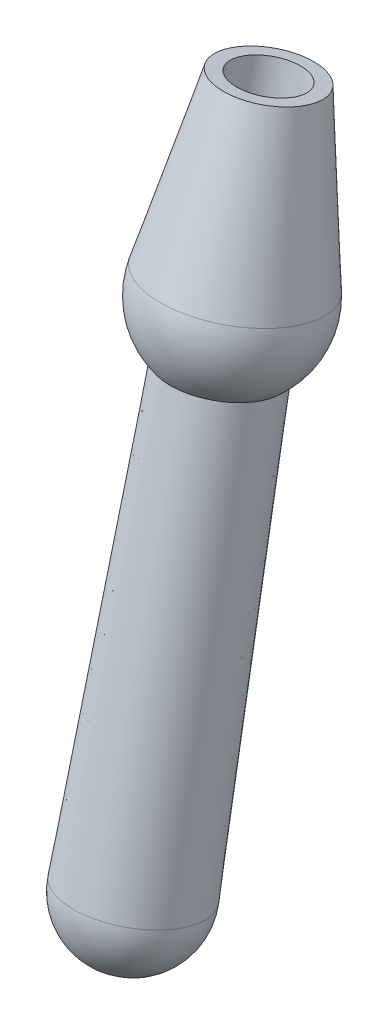
ISO-10303-21;
HEADER;
FILE_DESCRIPTION(('STEP AP214'),'2;1');
FILE_NAME('part.step','',(''),(''),'','','');
FILE_SCHEMA(('AUTOMOTIVE_DESIGN { 1 0 10303 214 1 1 1 1 }'));
ENDSEC;
DATA;
#1=APPLICATION_CONTEXT('core data for automotive mechanical design processes');
#2=APPLICATION_PROTOCOL_DEFINITION('international standard','automotive_design',2000,#1);
#3=PRODUCT_CONTEXT('',#1,'mechanical');
#4=PRODUCT('Part','Part','',(#3));
#5=PRODUCT_RELATED_PRODUCT_CATEGORY('part','',(#4));
#6=PRODUCT_DEFINITION_FORMATION('','',#4);
#7=PRODUCT_DEFINITION_CONTEXT('part definition',#1,'design');
#8=PRODUCT_DEFINITION('design','',#6,#7);
#9=PRODUCT_DEFINITION_SHAPE('','',#8);
#10=(LENGTH_UNIT() NAMED_UNIT(*) SI_UNIT(.MILLI.,.METRE.));
#11=(NAMED_UNIT(*) PLANE_ANGLE_UNIT() SI_UNIT($,.RADIAN.));
#12=(NAMED_UNIT(*) SI_UNIT($,.STERADIAN.) SOLID_ANGLE_UNIT());
#13=UNCERTAINTY_MEASURE_WITH_UNIT(LENGTH_MEASURE(1.E-05),#10,'distance_accuracy_value','');
#14=(GEOMETRIC_REPRESENTATION_CONTEXT(3) GLOBAL_UNCERTAINTY_ASSIGNED_CONTEXT((#13)) GLOBAL_UNIT_ASSIGNED_CONTEXT((#10,
#11,#12)) REPRESENTATION_CONTEXT('',''));
#15=CARTESIAN_POINT('',(0.,0.,0.));
#16=DIRECTION('',(0.,0.,1.));
#17=DIRECTION('',(1.,0.,0.));
#18=AXIS2_PLACEMENT_3D('',#15,#16,#17);
#19=CARTESIAN_POINT('',(0.,-5.43277859889929,1.55863020646956));
#20=DIRECTION('',(0.,0.978147600733806,-0.207911690817759));
#21=DIRECTION('',(0.,-0.207911690817759,-0.978147600733806));
#22=AXIS2_PLACEMENT_3D('',#19,#20,#21);
#23=SPHERICAL_SURFACE('',#22,0.8);
#24=CARTESIAN_POINT('',(0.,-5.4327785988993,1.55863020646956));
#25=DIRECTION('',(0.,0.978147600733806,-0.207911690817759));
#26=DIRECTION('',(0.,-0.207911690817759,-0.978147600733806));
#27=AXIS2_PLACEMENT_3D('',#24,#25,#26);
#28=CIRCLE('',#27,0.8);
#29=CARTESIAN_POINT('',(0.,-5.5991079515535,0.776112125882512));
#30=VERTEX_POINT('',#29);
#31=EDGE_CURVE('E11',#30,#30,#28,.T.);
#32=ORIENTED_EDGE('',*,*,#31,.T.);
#33=EDGE_LOOP('',(#32));
#34=FACE_BOUND('',#33,.T.);
#35=ADVANCED_FACE('F16',(#34),#23,.F.);
#36=CARTESIAN_POINT('',(0.,6.10936308975959,-0.894727745179999));
#37=DIRECTION('',(0.,0.978147600733806,-0.207911690817759));
#38=DIRECTION('',(0.,-0.207911690817759,-0.978147600733806));
#39=AXIS2_PLACEMENT_3D('',#36,#37,#38);
#40=CYLINDRICAL_SURFACE('',#39,0.8);
#41=ORIENTED_EDGE('',*,*,#31,.F.);
#42=EDGE_LOOP('',(#41));
#43=FACE_BOUND('',#42,.T.);
#44=CARTESIAN_POINT('',(0.,6.10936308975959,-0.894727745179999));
#45=DIRECTION('',(0.,0.978147600733806,-0.207911690817759));
#46=DIRECTION('',(0.,-0.207911690817759,-0.978147600733806));
#47=AXIS2_PLACEMENT_3D('',#44,#45,#46);
#48=CIRCLE('',#47,0.8);
#49=CARTESIAN_POINT('',(0.,5.94303373710538,-1.67724582576704));
#50=VERTEX_POINT('',#49);
#51=EDGE_CURVE('E20',#50,#50,#48,.T.);
#52=ORIENTED_EDGE('',*,*,#51,.T.);
#53=EDGE_LOOP('',(#52));
#54=FACE_BOUND('',#53,.T.);
#55=ADVANCED_FACE('F82',(#43,#54),#40,.F.);
#56=CARTESIAN_POINT('',(0.,6.10936308975959,-0.894727745179999));
#57=DIRECTION('',(0.,0.978147600733806,-0.207911690817759));
#58=DIRECTION('',(-1.,0.,0.));
#59=AXIS2_PLACEMENT_3D('',#56,#57,#58);
#60=PLANE('',#59);
#61=CARTESIAN_POINT('',(0.,6.10936308975959,-0.894727745179999));
#62=DIRECTION('',(0.,0.978147600733806,-0.207911690817759));
#63=DIRECTION('',(0.,-0.207911690817759,-0.978147600733806));
#64=AXIS2_PLACEMENT_3D('',#61,#62,#63);
#65=CIRCLE('',#64,1.12996469448049);
#66=CARTESIAN_POINT('',(0.,5.87443021956578,-2.));
#67=VERTEX_POINT('',#66);
#68=EDGE_CURVE('E66',#67,#67,#65,.T.);
#69=ORIENTED_EDGE('',*,*,#68,.T.);
#70=EDGE_LOOP('',(#69));
#71=FACE_BOUND('',#70,.T.);
#72=ORIENTED_EDGE('',*,*,#51,.F.);
#73=EDGE_LOOP('',(#72));
#74=FACE_BOUND('',#73,.T.);
#75=ADVANCED_FACE('F84',(#71,#74),#60,.T.);
#76=CARTESIAN_POINT('',(0.,4.17509450153618,-0.483586264720904));
#77=DIRECTION('',(0.,-0.978147600733806,0.207911690817759));
#78=DIRECTION('',(0.,0.207911690817759,0.978147600733806));
#79=AXIS2_PLACEMENT_3D('',#76,#77,#78);
#80=CONICAL_SURFACE('',#79,1.49887065025723,0.184433389020991);
#81=CARTESIAN_POINT('',(0.,2.24082591331277,-0.0724447842618082));
#82=DIRECTION('',(0.,0.978147600733806,-0.207911690817759));
#83=DIRECTION('',(0.,-0.207911690817759,-0.978147600733806));
#84=AXIS2_PLACEMENT_3D('',#81,#82,#83);
#85=CIRCLE('',#84,1.86777660603397);
#86=CARTESIAN_POINT('',(0.,1.8524933210824,-1.89940599016067));
#87=VERTEX_POINT('',#86);
#88=EDGE_CURVE('E57',#87,#87,#85,.T.);
#89=ORIENTED_EDGE('',*,*,#88,.T.);
#90=EDGE_LOOP('',(#89));
#91=FACE_BOUND('',#90,.T.);
#92=ORIENTED_EDGE('',*,*,#68,.F.);
#93=EDGE_LOOP('',(#92));
#94=FACE_BOUND('',#93,.T.);
#95=ADVANCED_FACE('F86',(#91,#94),#80,.T.);
#96=CARTESIAN_POINT('',(0.,1.9,0.));
#97=DIRECTION('',(0.,0.978147600733806,-0.207911690817759));
#98=DIRECTION('',(0.,-0.207911690817759,-0.978147600733806));
#99=AXIS2_PLACEMENT_3D('',#96,#97,#98);
#100=SPHERICAL_SURFACE('',#99,1.9);
#101=CARTESIAN_POINT('',(0.,0.490758694812245,0.299543486394084));
#102=DIRECTION('',(0.,0.978147600733806,-0.207911690817759));
#103=DIRECTION('',(0.,-0.207911690817759,-0.978147600733806));
#104=AXIS2_PLACEMENT_3D('',#101,#102,#103);
#105=CIRCLE('',#104,1.23867374377259);
#106=CARTESIAN_POINT('',(0.,0.233223942372924,-0.912062264169032));
#107=VERTEX_POINT('',#106);
#108=EDGE_CURVE('E53',#107,#107,#105,.T.);
#109=ORIENTED_EDGE('',*,*,#108,.T.);
#110=EDGE_LOOP('',(#109));
#111=FACE_BOUND('',#110,.T.);
#112=ORIENTED_EDGE('',*,*,#88,.F.);
#113=EDGE_LOOP('',(#112));
#114=FACE_BOUND('',#113,.T.);
#115=ADVANCED_FACE('F93',(#111,#114),#100,.T.);
#116=CARTESIAN_POINT('',(0.,-4.50227282022427,1.36084509754031));
#117=DIRECTION('',(0.,-0.978147600733806,0.207911690817759));
#118=DIRECTION('',(0.,0.207911690817759,0.978147600733806));
#119=AXIS2_PLACEMENT_3D('',#116,#117,#118);
#120=CONICAL_SURFACE('',#119,1.36909220397096,0.02554375170795);
#121=CARTESIAN_POINT('',(0.,-9.49530433526078,2.42214670868653));
#122=DIRECTION('',(0.,0.978147600733806,-0.207911690817759));
#123=DIRECTION('',(0.,-0.207911690817759,-0.978147600733806));
#124=AXIS2_PLACEMENT_3D('',#121,#122,#123);
#125=CIRCLE('',#124,1.49951066416933);
#126=CARTESIAN_POINT('',(0.,-9.80707013284749,0.955403950254541));
#127=VERTEX_POINT('',#126);
#128=EDGE_CURVE('E58',#127,#127,#125,.T.);
#129=ORIENTED_EDGE('',*,*,#128,.T.);
#130=EDGE_LOOP('',(#129));
#131=FACE_BOUND('',#130,.T.);
#132=ORIENTED_EDGE('',*,*,#108,.F.);
#133=EDGE_LOOP('',(#132));
#134=FACE_BOUND('',#133,.T.);
#135=ADVANCED_FACE('F54',(#131,#134),#120,.T.);
#136=CARTESIAN_POINT('',(0.,-9.53277859889929,2.43011210931665));
#137=DIRECTION('',(0.,0.978147600733806,-0.207911690817759));
#138=DIRECTION('',(0.,-0.207911690817759,-0.978147600733806));
#139=AXIS2_PLACEMENT_3D('',#136,#137,#138);
#140=SPHERICAL_SURFACE('',#139,1.5);
#141=ORIENTED_EDGE('',*,*,#128,.F.);
#142=EDGE_LOOP('',(#141));
#143=FACE_BOUND('',#142,.T.);
#144=ADVANCED_FACE('F18',(#143),#140,.T.);
#145=CLOSED_SHELL('',(#35,#55,#75,#95,#115,#135,#144));
#146=MANIFOLD_SOLID_BREP('B1',#145);
#147=ADVANCED_BREP_SHAPE_REPRESENTATION('',(#18,#146),#14);
#148=SHAPE_DEFINITION_REPRESENTATION(#9,#147);
ENDSEC;
END-ISO-10303-21;
